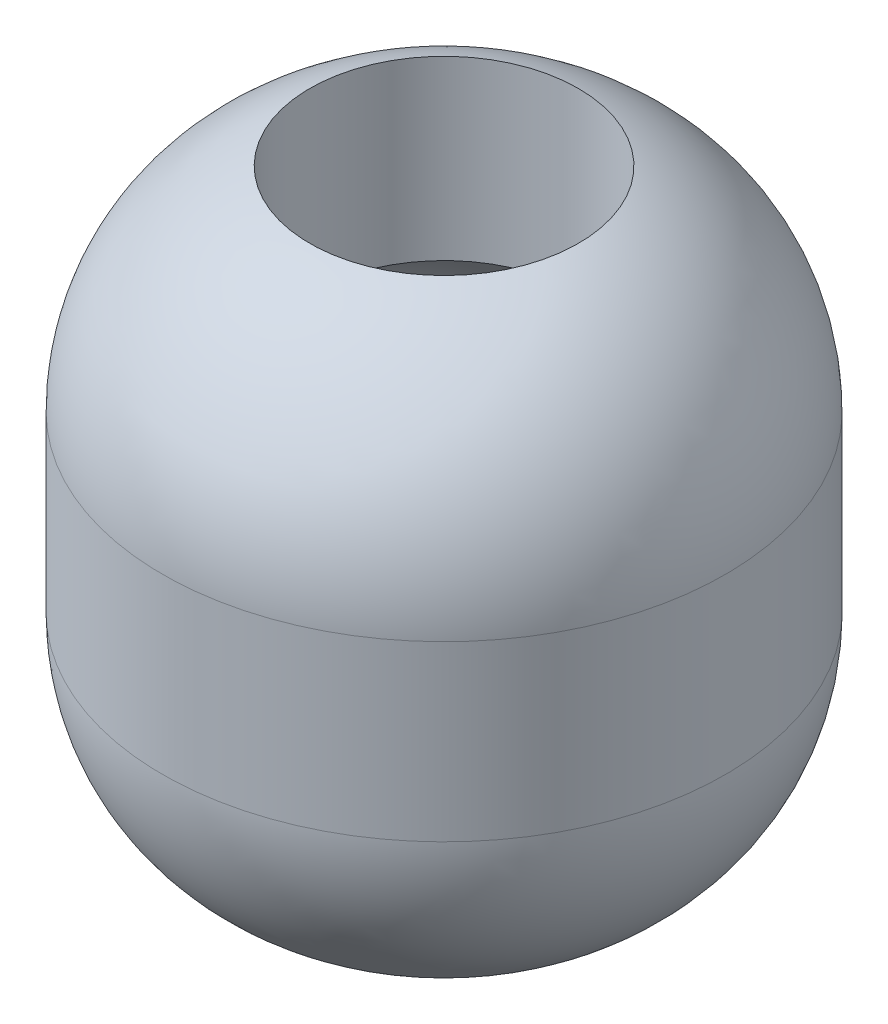
ISO-10303-21;
HEADER;
FILE_DESCRIPTION(('STEP AP214'),'2;1');
FILE_NAME('part.step','',(''),(''),'','','');
FILE_SCHEMA(('AUTOMOTIVE_DESIGN { 1 0 10303 214 1 1 1 1 }'));
ENDSEC;
DATA;
#1=APPLICATION_CONTEXT('core data for automotive mechanical design processes');
#2=APPLICATION_PROTOCOL_DEFINITION('international standard','automotive_design',2000,#1);
#3=PRODUCT_CONTEXT('',#1,'mechanical');
#4=PRODUCT('Part','Part','',(#3));
#5=PRODUCT_RELATED_PRODUCT_CATEGORY('part','',(#4));
#6=PRODUCT_DEFINITION_FORMATION('','',#4);
#7=PRODUCT_DEFINITION_CONTEXT('part definition',#1,'design');
#8=PRODUCT_DEFINITION('design','',#6,#7);
#9=PRODUCT_DEFINITION_SHAPE('','',#8);
#10=(LENGTH_UNIT() NAMED_UNIT(*) SI_UNIT(.MILLI.,.METRE.));
#11=(NAMED_UNIT(*) PLANE_ANGLE_UNIT() SI_UNIT($,.RADIAN.));
#12=(NAMED_UNIT(*) SI_UNIT($,.STERADIAN.) SOLID_ANGLE_UNIT());
#13=UNCERTAINTY_MEASURE_WITH_UNIT(LENGTH_MEASURE(1.E-05),#10,'distance_accuracy_value','');
#14=(GEOMETRIC_REPRESENTATION_CONTEXT(3) GLOBAL_UNCERTAINTY_ASSIGNED_CONTEXT((#13)) GLOBAL_UNIT_ASSIGNED_CONTEXT((#10,
#11,#12)) REPRESENTATION_CONTEXT('',''));
#15=CARTESIAN_POINT('',(0.,0.,0.));
#16=DIRECTION('',(0.,0.,1.));
#17=DIRECTION('',(1.,0.,0.));
#18=AXIS2_PLACEMENT_3D('',#15,#16,#17);
#19=CARTESIAN_POINT('',(0.,277.524719286955,0.));
#20=DIRECTION('',(0.,-1.,0.));
#21=DIRECTION('',(0.,0.,-1.));
#22=AXIS2_PLACEMENT_3D('',#19,#20,#21);
#23=DEGENERATE_TOROIDAL_SURFACE('',#22,33.35,141.65,.T.);
#24=CARTESIAN_POINT('',(0.,277.524719286955,0.));
#25=DIRECTION('',(0.,-1.,0.));
#26=DIRECTION('',(0.,0.,-1.));
#27=AXIS2_PLACEMENT_3D('',#24,#25,#26);
#28=CIRCLE('',#27,175.);
#29=CARTESIAN_POINT('',(0.,277.524719286955,-175.));
#30=VERTEX_POINT('',#29);
#31=EDGE_CURVE('E10',#30,#30,#28,.T.);
#32=ORIENTED_EDGE('',*,*,#31,.F.);
#33=EDGE_LOOP('',(#32));
#34=FACE_BOUND('',#33,.T.);
#35=CARTESIAN_POINT('',(0.,410.,0.));
#36=DIRECTION('',(0.,-1.,0.));
#37=DIRECTION('',(0.,0.,-1.));
#38=AXIS2_PLACEMENT_3D('',#35,#36,#37);
#39=CIRCLE('',#38,83.5000000000001);
#40=CARTESIAN_POINT('',(0.,410.,-83.5000000000001));
#41=VERTEX_POINT('',#40);
#42=EDGE_CURVE('E64',#41,#41,#39,.T.);
#43=ORIENTED_EDGE('',*,*,#42,.T.);
#44=EDGE_LOOP('',(#43));
#45=FACE_BOUND('',#44,.T.);
#46=ADVANCED_FACE('F33',(#34,#45),#23,.T.);
#47=CARTESIAN_POINT('',(0.,0.,0.));
#48=DIRECTION('',(0.,-1.,0.));
#49=DIRECTION('',(0.,0.,-1.));
#50=AXIS2_PLACEMENT_3D('',#47,#48,#49);
#51=CYLINDRICAL_SURFACE('',#50,175.);
#52=CARTESIAN_POINT('',(0.,169.744572197564,0.));
#53=DIRECTION('',(0.,-1.,0.));
#54=DIRECTION('',(0.,0.,-1.));
#55=AXIS2_PLACEMENT_3D('',#52,#53,#54);
#56=CIRCLE('',#55,175.);
#57=CARTESIAN_POINT('',(0.,169.744572197564,-175.));
#58=VERTEX_POINT('',#57);
#59=EDGE_CURVE('E39',#58,#58,#56,.T.);
#60=ORIENTED_EDGE('',*,*,#59,.F.);
#61=EDGE_LOOP('',(#60));
#62=FACE_BOUND('',#61,.T.);
#63=ORIENTED_EDGE('',*,*,#31,.T.);
#64=EDGE_LOOP('',(#63));
#65=FACE_BOUND('',#64,.T.);
#66=ADVANCED_FACE('F107',(#62,#65),#51,.T.);
#67=CARTESIAN_POINT('',(0.,169.744572197564,0.));
#68=DIRECTION('',(0.,-1.,0.));
#69=DIRECTION('',(0.,0.,-1.));
#70=AXIS2_PLACEMENT_3D('',#67,#68,#69);
#71=DEGENERATE_TOROIDAL_SURFACE('',#70,33.35,141.65,.T.);
#72=CARTESIAN_POINT('',(0.,55.,0.));
#73=DIRECTION('',(0.,-1.,0.));
#74=DIRECTION('',(0.,0.,-1.));
#75=AXIS2_PLACEMENT_3D('',#72,#73,#74);
#76=CIRCLE('',#75,116.406641222711);
#77=CARTESIAN_POINT('',(0.,55.,-116.406641222711));
#78=VERTEX_POINT('',#77);
#79=EDGE_CURVE('E43',#78,#78,#76,.T.);
#80=ORIENTED_EDGE('',*,*,#79,.F.);
#81=EDGE_LOOP('',(#80));
#82=FACE_BOUND('',#81,.T.);
#83=ORIENTED_EDGE('',*,*,#59,.T.);
#84=EDGE_LOOP('',(#83));
#85=FACE_BOUND('',#84,.T.);
#86=ADVANCED_FACE('F102',(#82,#85),#71,.T.);
#87=CARTESIAN_POINT('',(0.,55.,0.));
#88=DIRECTION('',(0.,-1.,0.));
#89=DIRECTION('',(0.,0.,-1.));
#90=AXIS2_PLACEMENT_3D('',#87,#88,#89);
#91=CONICAL_SURFACE('',#90,116.406641222711,0.610865238198014);
#92=CARTESIAN_POINT('',(0.,87.,0.));
#93=DIRECTION('',(0.,-1.,0.));
#94=DIRECTION('',(0.,0.,-1.));
#95=AXIS2_PLACEMENT_3D('',#92,#93,#94);
#96=CIRCLE('',#95,94.);
#97=CARTESIAN_POINT('',(0.,87.,-94.));
#98=VERTEX_POINT('',#97);
#99=EDGE_CURVE('E47',#98,#98,#96,.T.);
#100=ORIENTED_EDGE('',*,*,#99,.F.);
#101=EDGE_LOOP('',(#100));
#102=FACE_BOUND('',#101,.T.);
#103=ORIENTED_EDGE('',*,*,#79,.T.);
#104=EDGE_LOOP('',(#103));
#105=FACE_BOUND('',#104,.T.);
#106=ADVANCED_FACE('F96',(#102,#105),#91,.F.);
#107=CARTESIAN_POINT('',(-36.,87.,0.));
#108=DIRECTION('',(0.,1.,0.));
#109=DIRECTION('',(0.,0.,1.));
#110=AXIS2_PLACEMENT_3D('',#107,#108,#109);
#111=PLANE('',#110);
#112=CARTESIAN_POINT('',(0.,87.,0.));
#113=DIRECTION('',(0.,-1.,0.));
#114=DIRECTION('',(0.,0.,-1.));
#115=AXIS2_PLACEMENT_3D('',#112,#113,#114);
#116=CIRCLE('',#115,36.);
#117=CARTESIAN_POINT('',(0.,87.,-36.));
#118=VERTEX_POINT('',#117);
#119=EDGE_CURVE('E52',#118,#118,#116,.T.);
#120=ORIENTED_EDGE('',*,*,#119,.F.);
#121=EDGE_LOOP('',(#120));
#122=FACE_BOUND('',#121,.T.);
#123=ORIENTED_EDGE('',*,*,#99,.T.);
#124=EDGE_LOOP('',(#123));
#125=FACE_BOUND('',#124,.T.);
#126=ADVANCED_FACE('F90',(#122,#125),#111,.F.);
#127=CARTESIAN_POINT('',(0.,0.,0.));
#128=DIRECTION('',(0.,-1.,0.));
#129=DIRECTION('',(0.,0.,-1.));
#130=AXIS2_PLACEMENT_3D('',#127,#128,#129);
#131=CYLINDRICAL_SURFACE('',#130,36.0000000000001);
#132=CARTESIAN_POINT('',(0.,140.,0.));
#133=DIRECTION('',(0.,-1.,0.));
#134=DIRECTION('',(0.,0.,-1.));
#135=AXIS2_PLACEMENT_3D('',#132,#133,#134);
#136=CIRCLE('',#135,36.0000000000001);
#137=CARTESIAN_POINT('',(0.,140.,-36.0000000000001));
#138=VERTEX_POINT('',#137);
#139=EDGE_CURVE('E55',#138,#138,#136,.T.);
#140=ORIENTED_EDGE('',*,*,#139,.F.);
#141=EDGE_LOOP('',(#140));
#142=FACE_BOUND('',#141,.T.);
#143=ORIENTED_EDGE('',*,*,#119,.T.);
#144=EDGE_LOOP('',(#143));
#145=FACE_BOUND('',#144,.T.);
#146=ADVANCED_FACE('F84',(#142,#145),#131,.F.);
#147=CARTESIAN_POINT('',(0.,282.785714285714,0.));
#148=DIRECTION('',(0.,-1.,0.));
#149=DIRECTION('',(0.,0.,-1.));
#150=AXIS2_PLACEMENT_3D('',#147,#148,#149);
#151=DEGENERATE_TOROIDAL_SURFACE('',#150,33.35,142.810303214025,.T.);
#152=CARTESIAN_POINT('',(0.,224.,0.));
#153=DIRECTION('',(0.,-1.,0.));
#154=DIRECTION('',(0.,0.,-1.));
#155=AXIS2_PLACEMENT_3D('',#152,#153,#154);
#156=CIRCLE('',#155,163.5);
#157=CARTESIAN_POINT('',(0.,224.,-163.5));
#158=VERTEX_POINT('',#157);
#159=EDGE_CURVE('E58',#158,#158,#156,.T.);
#160=ORIENTED_EDGE('',*,*,#159,.F.);
#161=EDGE_LOOP('',(#160));
#162=FACE_BOUND('',#161,.T.);
#163=ORIENTED_EDGE('',*,*,#139,.T.);
#164=EDGE_LOOP('',(#163));
#165=FACE_BOUND('',#164,.T.);
#166=ADVANCED_FACE('F78',(#162,#165),#151,.F.);
#167=CARTESIAN_POINT('',(0.,167.105263157895,0.));
#168=DIRECTION('',(0.,-1.,0.));
#169=DIRECTION('',(0.,0.,-1.));
#170=AXIS2_PLACEMENT_3D('',#167,#168,#169);
#171=DEGENERATE_TOROIDAL_SURFACE('',#170,33.35,142.042365441907,.T.);
#172=CARTESIAN_POINT('',(0.,300.,0.));
#173=DIRECTION('',(0.,-1.,0.));
#174=DIRECTION('',(0.,0.,-1.));
#175=AXIS2_PLACEMENT_3D('',#172,#173,#174);
#176=CIRCLE('',#175,83.5000000000001);
#177=CARTESIAN_POINT('',(0.,300.,-83.5000000000001));
#178=VERTEX_POINT('',#177);
#179=EDGE_CURVE('E61',#178,#178,#176,.T.);
#180=ORIENTED_EDGE('',*,*,#179,.F.);
#181=EDGE_LOOP('',(#180));
#182=FACE_BOUND('',#181,.T.);
#183=ORIENTED_EDGE('',*,*,#159,.T.);
#184=EDGE_LOOP('',(#183));
#185=FACE_BOUND('',#184,.T.);
#186=ADVANCED_FACE('F72',(#182,#185),#171,.F.);
#187=CARTESIAN_POINT('',(0.,0.,0.));
#188=DIRECTION('',(0.,-1.,0.));
#189=DIRECTION('',(0.,0.,-1.));
#190=AXIS2_PLACEMENT_3D('',#187,#188,#189);
#191=CYLINDRICAL_SURFACE('',#190,83.5000000000001);
#192=ORIENTED_EDGE('',*,*,#42,.F.);
#193=EDGE_LOOP('',(#192));
#194=FACE_BOUND('',#193,.T.);
#195=ORIENTED_EDGE('',*,*,#179,.T.);
#196=EDGE_LOOP('',(#195));
#197=FACE_BOUND('',#196,.T.);
#198=ADVANCED_FACE('F69',(#194,#197),#191,.F.);
#199=CLOSED_SHELL('',(#46,#66,#86,#106,#126,#146,#166,#186,#198));
#200=MANIFOLD_SOLID_BREP('B2',#199);
#201=ADVANCED_BREP_SHAPE_REPRESENTATION('',(#18,#200),#14);
#202=SHAPE_DEFINITION_REPRESENTATION(#9,#201);
ENDSEC;
END-ISO-10303-21;
